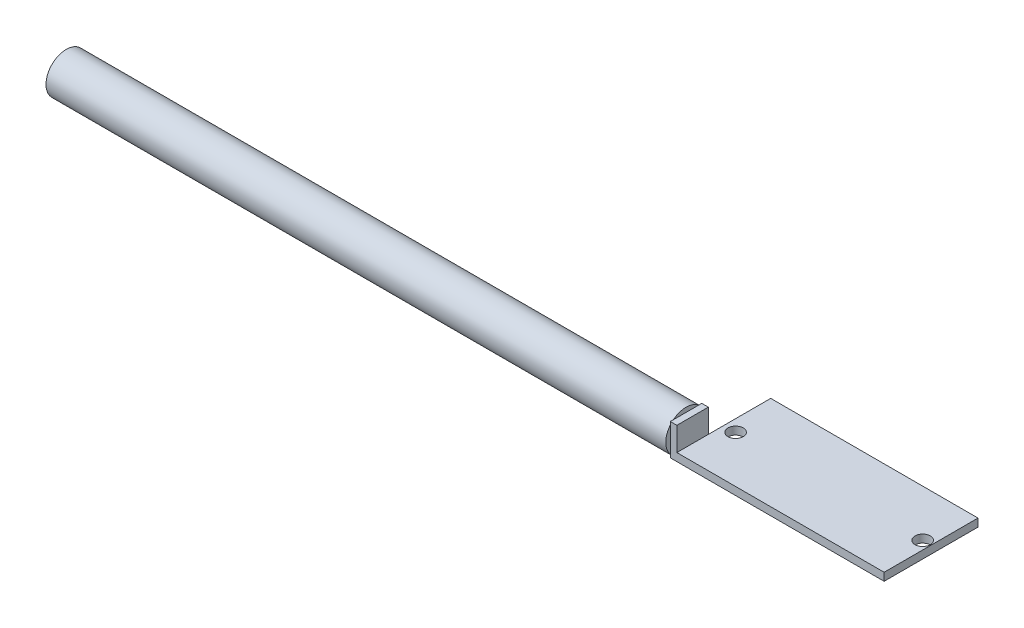
ISO-10303-21;
HEADER;
FILE_DESCRIPTION(('STEP AP214'),'2;1');
FILE_NAME('part.step','',(''),(''),'','','');
FILE_SCHEMA(('AUTOMOTIVE_DESIGN { 1 0 10303 214 1 1 1 1 }'));
ENDSEC;
DATA;
#1=APPLICATION_CONTEXT('core data for automotive mechanical design processes');
#2=APPLICATION_PROTOCOL_DEFINITION('international standard','automotive_design',2000,#1);
#3=PRODUCT_CONTEXT('',#1,'mechanical');
#4=PRODUCT('Part','Part','',(#3));
#5=PRODUCT_RELATED_PRODUCT_CATEGORY('part','',(#4));
#6=PRODUCT_DEFINITION_FORMATION('','',#4);
#7=PRODUCT_DEFINITION_CONTEXT('part definition',#1,'design');
#8=PRODUCT_DEFINITION('design','',#6,#7);
#9=PRODUCT_DEFINITION_SHAPE('','',#8);
#10=(LENGTH_UNIT() NAMED_UNIT(*) SI_UNIT(.MILLI.,.METRE.));
#11=(NAMED_UNIT(*) PLANE_ANGLE_UNIT() SI_UNIT($,.RADIAN.));
#12=(NAMED_UNIT(*) SI_UNIT($,.STERADIAN.) SOLID_ANGLE_UNIT());
#13=UNCERTAINTY_MEASURE_WITH_UNIT(LENGTH_MEASURE(1.E-05),#10,'distance_accuracy_value','');
#14=(GEOMETRIC_REPRESENTATION_CONTEXT(3) GLOBAL_UNCERTAINTY_ASSIGNED_CONTEXT((#13)) GLOBAL_UNIT_ASSIGNED_CONTEXT((#10,
#11,#12)) REPRESENTATION_CONTEXT('',''));
#15=CARTESIAN_POINT('',(0.,0.,0.));
#16=DIRECTION('',(0.,0.,1.));
#17=DIRECTION('',(1.,0.,0.));
#18=AXIS2_PLACEMENT_3D('',#15,#16,#17);
#19=CARTESIAN_POINT('',(-21.336,0.,0.));
#20=DIRECTION('',(-1.,0.,0.));
#21=DIRECTION('',(0.,0.,1.));
#22=AXIS2_PLACEMENT_3D('',#19,#20,#21);
#23=PLANE('',#22);
#24=CARTESIAN_POINT('',(-21.336,3.048,6.03885));
#25=DIRECTION('',(-1.,0.,0.));
#26=DIRECTION('',(0.,0.,1.));
#27=AXIS2_PLACEMENT_3D('',#24,#25,#26);
#28=CIRCLE('',#27,3.91795);
#29=CARTESIAN_POINT('',(-21.336,5.50971245325282,9.08685));
#30=VERTEX_POINT('',#29);
#31=CARTESIAN_POINT('',(-21.336,6.096,8.50056245325282));
#32=VERTEX_POINT('',#31);
#33=EDGE_CURVE('E151',#30,#32,#28,.T.);
#34=ORIENTED_EDGE('',*,*,#33,.F.);
#35=DIRECTION('',(0.,1.,0.));
#36=VECTOR('',#35,1.);
#37=CARTESIAN_POINT('',(-21.336,0.,9.08685));
#38=LINE('',#37,#36);
#39=CARTESIAN_POINT('',(-21.336,6.096,9.08685));
#40=VERTEX_POINT('',#39);
#41=EDGE_CURVE('E137',#30,#40,#38,.T.);
#42=ORIENTED_EDGE('',*,*,#41,.T.);
#43=DIRECTION('',(0.,0.,-1.));
#44=VECTOR('',#43,1.);
#45=CARTESIAN_POINT('',(-21.336,6.096,9.08685));
#46=LINE('',#45,#44);
#47=EDGE_CURVE('E180',#40,#32,#46,.T.);
#48=ORIENTED_EDGE('',*,*,#47,.T.);
#49=EDGE_LOOP('',(#34,#42,#48));
#50=FACE_BOUND('',#49,.T.);
#51=ADVANCED_FACE('F40',(#50),#23,.T.);
#52=CARTESIAN_POINT('',(-21.336,6.096,3.57713754674718));
#53=VERTEX_POINT('',#52);
#54=CARTESIAN_POINT('',(-21.336,5.50971245325282,2.99085));
#55=VERTEX_POINT('',#54);
#56=EDGE_CURVE('E11',#53,#55,#28,.T.);
#57=ORIENTED_EDGE('',*,*,#56,.F.);
#58=CARTESIAN_POINT('',(-21.336,6.096,2.99085));
#59=VERTEX_POINT('',#58);
#60=EDGE_CURVE('E134',#53,#59,#46,.T.);
#61=ORIENTED_EDGE('',*,*,#60,.T.);
#62=DIRECTION('',(0.,-1.,0.));
#63=VECTOR('',#62,1.);
#64=CARTESIAN_POINT('',(-21.336,0.,2.99085));
#65=LINE('',#64,#63);
#66=EDGE_CURVE('E177',#59,#55,#65,.T.);
#67=ORIENTED_EDGE('',*,*,#66,.T.);
#68=EDGE_LOOP('',(#57,#61,#67));
#69=FACE_BOUND('',#68,.T.);
#70=ADVANCED_FACE('F257',(#69),#23,.T.);
#71=CARTESIAN_POINT('',(-21.336,0.586287546747183,2.99085));
#72=VERTEX_POINT('',#71);
#73=CARTESIAN_POINT('',(-21.336,0.,3.57713754674719));
#74=VERTEX_POINT('',#73);
#75=EDGE_CURVE('E49',#72,#74,#28,.T.);
#76=ORIENTED_EDGE('',*,*,#75,.F.);
#77=CARTESIAN_POINT('',(-21.336,0.,2.99085));
#78=VERTEX_POINT('',#77);
#79=EDGE_CURVE('E178',#72,#78,#65,.T.);
#80=ORIENTED_EDGE('',*,*,#79,.T.);
#81=DIRECTION('',(0.,0.,1.));
#82=VECTOR('',#81,1.);
#83=CARTESIAN_POINT('',(-21.336,0.,9.08685));
#84=LINE('',#83,#82);
#85=EDGE_CURVE('E183',#78,#74,#84,.T.);
#86=ORIENTED_EDGE('',*,*,#85,.T.);
#87=EDGE_LOOP('',(#76,#80,#86));
#88=FACE_BOUND('',#87,.T.);
#89=ADVANCED_FACE('F274',(#88),#23,.T.);
#90=CARTESIAN_POINT('',(-20.066,1.524,9.08685));
#91=DIRECTION('',(1.,0.,0.));
#92=DIRECTION('',(0.,0.,-1.));
#93=AXIS2_PLACEMENT_3D('',#90,#91,#92);
#94=PLANE('',#93);
#95=DIRECTION('',(0.,-1.,0.));
#96=VECTOR('',#95,1.);
#97=CARTESIAN_POINT('',(-20.066,0.,2.99085));
#98=LINE('',#97,#96);
#99=CARTESIAN_POINT('',(-20.066,1.524,2.99085));
#100=VERTEX_POINT('',#99);
#101=CARTESIAN_POINT('',(-20.066,0.,2.99085));
#102=VERTEX_POINT('',#101);
#103=EDGE_CURVE('E156',#100,#102,#98,.T.);
#104=ORIENTED_EDGE('',*,*,#103,.F.);
#105=DIRECTION('',(0.,0.,1.));
#106=VECTOR('',#105,1.);
#107=CARTESIAN_POINT('',(-20.066,1.524,9.08685));
#108=LINE('',#107,#106);
#109=CARTESIAN_POINT('',(-20.066,1.524,-9.08685));
#110=VERTEX_POINT('',#109);
#111=EDGE_CURVE('E206',#110,#100,#108,.T.);
#112=ORIENTED_EDGE('',*,*,#111,.F.);
#113=DIRECTION('',(0.,-1.,0.));
#114=VECTOR('',#113,1.);
#115=CARTESIAN_POINT('',(-20.066,1.524,-9.08685));
#116=LINE('',#115,#114);
#117=CARTESIAN_POINT('',(-20.066,0.,-9.08685));
#118=VERTEX_POINT('',#117);
#119=EDGE_CURVE('E220',#110,#118,#116,.T.);
#120=ORIENTED_EDGE('',*,*,#119,.T.);
#121=DIRECTION('',(0.,0.,1.));
#122=VECTOR('',#121,1.);
#123=CARTESIAN_POINT('',(-20.066,0.,9.08685));
#124=LINE('',#123,#122);
#125=EDGE_CURVE('E216',#118,#102,#124,.T.);
#126=ORIENTED_EDGE('',*,*,#125,.T.);
#127=EDGE_LOOP('',(#104,#112,#120,#126));
#128=FACE_BOUND('',#127,.T.);
#129=ADVANCED_FACE('F236',(#128),#94,.F.);
#130=CARTESIAN_POINT('',(20.066,1.524,9.08685));
#131=DIRECTION('',(-1.,0.,0.));
#132=DIRECTION('',(0.,0.,1.));
#133=AXIS2_PLACEMENT_3D('',#130,#131,#132);
#134=PLANE('',#133);
#135=DIRECTION('',(0.,0.,-1.));
#136=VECTOR('',#135,1.);
#137=CARTESIAN_POINT('',(20.066,0.,9.08685));
#138=LINE('',#137,#136);
#139=CARTESIAN_POINT('',(20.066,0.,9.08685));
#140=VERTEX_POINT('',#139);
#141=CARTESIAN_POINT('',(20.066,0.,-9.08685));
#142=VERTEX_POINT('',#141);
#143=EDGE_CURVE('E198',#140,#142,#138,.T.);
#144=ORIENTED_EDGE('',*,*,#143,.T.);
#145=DIRECTION('',(0.,-1.,0.));
#146=VECTOR('',#145,1.);
#147=CARTESIAN_POINT('',(20.066,1.524,-9.08685));
#148=LINE('',#147,#146);
#149=CARTESIAN_POINT('',(20.066,1.524,-9.08685));
#150=VERTEX_POINT('',#149);
#151=EDGE_CURVE('E44',#150,#142,#148,.T.);
#152=ORIENTED_EDGE('',*,*,#151,.F.);
#153=DIRECTION('',(0.,0.,-1.));
#154=VECTOR('',#153,1.);
#155=CARTESIAN_POINT('',(20.066,1.524,9.08685));
#156=LINE('',#155,#154);
#157=CARTESIAN_POINT('',(20.066,1.524,9.08685));
#158=VERTEX_POINT('',#157);
#159=EDGE_CURVE('E199',#158,#150,#156,.T.);
#160=ORIENTED_EDGE('',*,*,#159,.F.);
#161=DIRECTION('',(0.,-1.,0.));
#162=VECTOR('',#161,1.);
#163=CARTESIAN_POINT('',(20.066,1.524,9.08685));
#164=LINE('',#163,#162);
#165=EDGE_CURVE('E211',#158,#140,#164,.T.);
#166=ORIENTED_EDGE('',*,*,#165,.T.);
#167=EDGE_LOOP('',(#144,#152,#160,#166));
#168=FACE_BOUND('',#167,.T.);
#169=ADVANCED_FACE('F42',(#168),#134,.F.);
#170=CARTESIAN_POINT('',(-20.066,1.524,-9.08685));
#171=DIRECTION('',(0.,0.,1.));
#172=DIRECTION('',(1.,0.,0.));
#173=AXIS2_PLACEMENT_3D('',#170,#171,#172);
#174=PLANE('',#173);
#175=DIRECTION('',(-1.,0.,0.));
#176=VECTOR('',#175,1.);
#177=CARTESIAN_POINT('',(-20.066,0.,-9.08685));
#178=LINE('',#177,#176);
#179=EDGE_CURVE('E214',#142,#118,#178,.T.);
#180=ORIENTED_EDGE('',*,*,#179,.T.);
#181=ORIENTED_EDGE('',*,*,#119,.F.);
#182=DIRECTION('',(-1.,0.,0.));
#183=VECTOR('',#182,1.);
#184=CARTESIAN_POINT('',(-20.066,1.524,-9.08685));
#185=LINE('',#184,#183);
#186=EDGE_CURVE('E202',#150,#110,#185,.T.);
#187=ORIENTED_EDGE('',*,*,#186,.F.);
#188=ORIENTED_EDGE('',*,*,#151,.T.);
#189=EDGE_LOOP('',(#180,#181,#187,#188));
#190=FACE_BOUND('',#189,.T.);
#191=ADVANCED_FACE('F229',(#190),#174,.F.);
#192=CARTESIAN_POINT('',(-20.066,1.524,9.08685));
#193=DIRECTION('',(0.,0.,-1.));
#194=DIRECTION('',(-1.,0.,0.));
#195=AXIS2_PLACEMENT_3D('',#192,#193,#194);
#196=PLANE('',#195);
#197=DIRECTION('',(1.,0.,0.));
#198=VECTOR('',#197,1.);
#199=CARTESIAN_POINT('',(-20.066,0.,9.08685));
#200=LINE('',#199,#198);
#201=CARTESIAN_POINT('',(-21.336,0.,9.08685));
#202=VERTEX_POINT('',#201);
#203=EDGE_CURVE('E203',#202,#140,#200,.T.);
#204=ORIENTED_EDGE('',*,*,#203,.T.);
#205=ORIENTED_EDGE('',*,*,#165,.F.);
#206=DIRECTION('',(1.,0.,0.));
#207=VECTOR('',#206,1.);
#208=CARTESIAN_POINT('',(-20.066,1.524,9.08685));
#209=LINE('',#208,#207);
#210=CARTESIAN_POINT('',(-20.066,1.524,9.08685));
#211=VERTEX_POINT('',#210);
#212=EDGE_CURVE('E209',#211,#158,#209,.T.);
#213=ORIENTED_EDGE('',*,*,#212,.F.);
#214=DIRECTION('',(0.,1.,0.));
#215=VECTOR('',#214,1.);
#216=CARTESIAN_POINT('',(-20.066,0.,9.08685));
#217=LINE('',#216,#215);
#218=CARTESIAN_POINT('',(-20.066,6.096,9.08685));
#219=VERTEX_POINT('',#218);
#220=EDGE_CURVE('E164',#211,#219,#217,.T.);
#221=ORIENTED_EDGE('',*,*,#220,.T.);
#222=DIRECTION('',(1.,0.,0.));
#223=VECTOR('',#222,1.);
#224=CARTESIAN_POINT('',(-21.336,6.096,9.08685));
#225=LINE('',#224,#223);
#226=EDGE_CURVE('E195',#40,#219,#225,.T.);
#227=ORIENTED_EDGE('',*,*,#226,.F.);
#228=ORIENTED_EDGE('',*,*,#41,.F.);
#229=CARTESIAN_POINT('',(-21.336,0.586287546747183,9.08685));
#230=VERTEX_POINT('',#229);
#231=EDGE_CURVE('E135',#230,#30,#38,.T.);
#232=ORIENTED_EDGE('',*,*,#231,.F.);
#233=EDGE_CURVE('E128',#202,#230,#38,.T.);
#234=ORIENTED_EDGE('',*,*,#233,.F.);
#235=EDGE_LOOP('',(#204,#205,#213,#221,#227,#228,#232,#234));
#236=FACE_BOUND('',#235,.T.);
#237=ADVANCED_FACE('F141',(#236),#196,.F.);
#238=CARTESIAN_POINT('',(0.,1.524,0.));
#239=DIRECTION('',(0.,-1.,0.));
#240=DIRECTION('',(0.,0.,-1.));
#241=AXIS2_PLACEMENT_3D('',#238,#239,#240);
#242=PLANE('',#241);
#243=CARTESIAN_POINT('',(-17.776825,1.524,0.));
#244=DIRECTION('',(0.,1.,0.));
#245=DIRECTION('',(0.,0.,1.));
#246=AXIS2_PLACEMENT_3D('',#243,#244,#245);
#247=CIRCLE('',#246,1.476375);
#248=CARTESIAN_POINT('',(-17.776825,1.524,1.476375));
#249=VERTEX_POINT('',#248);
#250=EDGE_CURVE('E315',#249,#249,#247,.T.);
#251=ORIENTED_EDGE('',*,*,#250,.F.);
#252=EDGE_LOOP('',(#251));
#253=FACE_BOUND('',#252,.T.);
#254=CARTESIAN_POINT('',(18.437225,1.524,0.));
#255=DIRECTION('',(0.,1.,0.));
#256=DIRECTION('',(0.,0.,1.));
#257=AXIS2_PLACEMENT_3D('',#254,#255,#256);
#258=CIRCLE('',#257,1.476375);
#259=CARTESIAN_POINT('',(18.437225,1.524,1.47637499999999));
#260=VERTEX_POINT('',#259);
#261=EDGE_CURVE('E323',#260,#260,#258,.T.);
#262=ORIENTED_EDGE('',*,*,#261,.F.);
#263=EDGE_LOOP('',(#262));
#264=FACE_BOUND('',#263,.T.);
#265=ORIENTED_EDGE('',*,*,#159,.T.);
#266=ORIENTED_EDGE('',*,*,#186,.T.);
#267=ORIENTED_EDGE('',*,*,#111,.T.);
#268=EDGE_CURVE('E205',#100,#211,#108,.T.);
#269=ORIENTED_EDGE('',*,*,#268,.T.);
#270=ORIENTED_EDGE('',*,*,#212,.T.);
#271=EDGE_LOOP('',(#265,#266,#267,#269,#270));
#272=FACE_BOUND('',#271,.T.);
#273=ADVANCED_FACE('F247',(#253,#264,#272),#242,.F.);
#274=CARTESIAN_POINT('',(0.,0.,0.));
#275=DIRECTION('',(0.,-1.,0.));
#276=DIRECTION('',(0.,0.,-1.));
#277=AXIS2_PLACEMENT_3D('',#274,#275,#276);
#278=PLANE('',#277);
#279=CARTESIAN_POINT('',(-17.776825,0.,0.));
#280=DIRECTION('',(0.,-1.,0.));
#281=DIRECTION('',(0.,0.,-1.));
#282=AXIS2_PLACEMENT_3D('',#279,#280,#281);
#283=CIRCLE('',#282,1.476375);
#284=CARTESIAN_POINT('',(-17.776825,0.,-1.476375));
#285=VERTEX_POINT('',#284);
#286=EDGE_CURVE('E150',#285,#285,#283,.F.);
#287=ORIENTED_EDGE('',*,*,#286,.T.);
#288=EDGE_LOOP('',(#287));
#289=FACE_BOUND('',#288,.T.);
#290=CARTESIAN_POINT('',(18.437225,0.,0.));
#291=DIRECTION('',(0.,-1.,0.));
#292=DIRECTION('',(0.,0.,-1.));
#293=AXIS2_PLACEMENT_3D('',#290,#291,#292);
#294=CIRCLE('',#293,1.476375);
#295=CARTESIAN_POINT('',(18.437225,0.,-1.476375));
#296=VERTEX_POINT('',#295);
#297=EDGE_CURVE('E320',#296,#296,#294,.F.);
#298=ORIENTED_EDGE('',*,*,#297,.T.);
#299=EDGE_LOOP('',(#298));
#300=FACE_BOUND('',#299,.T.);
#301=ORIENTED_EDGE('',*,*,#143,.F.);
#302=ORIENTED_EDGE('',*,*,#203,.F.);
#303=CARTESIAN_POINT('',(-21.336,0.,8.50056245325282));
#304=VERTEX_POINT('',#303);
#305=EDGE_CURVE('E131',#304,#202,#84,.T.);
#306=ORIENTED_EDGE('',*,*,#305,.F.);
#307=EDGE_CURVE('E65',#74,#304,#84,.T.);
#308=ORIENTED_EDGE('',*,*,#307,.F.);
#309=ORIENTED_EDGE('',*,*,#85,.F.);
#310=DIRECTION('',(1.,0.,0.));
#311=VECTOR('',#310,1.);
#312=CARTESIAN_POINT('',(-21.336,0.,2.99085));
#313=LINE('',#312,#311);
#314=EDGE_CURVE('E185',#78,#102,#313,.T.);
#315=ORIENTED_EDGE('',*,*,#314,.T.);
#316=ORIENTED_EDGE('',*,*,#125,.F.);
#317=ORIENTED_EDGE('',*,*,#179,.F.);
#318=EDGE_LOOP('',(#301,#302,#306,#308,#309,#315,#316,#317));
#319=FACE_BOUND('',#318,.T.);
#320=ADVANCED_FACE('F234',(#289,#300,#319),#278,.T.);
#321=CARTESIAN_POINT('',(-21.336,6.096,9.08685));
#322=DIRECTION('',(0.,-1.,0.));
#323=DIRECTION('',(0.,0.,-1.));
#324=AXIS2_PLACEMENT_3D('',#321,#322,#323);
#325=PLANE('',#324);
#326=DIRECTION('',(0.,0.,-1.));
#327=VECTOR('',#326,1.);
#328=CARTESIAN_POINT('',(-20.066,6.096,9.08685));
#329=LINE('',#328,#327);
#330=CARTESIAN_POINT('',(-20.066,6.096,2.99085));
#331=VERTEX_POINT('',#330);
#332=EDGE_CURVE('E187',#219,#331,#329,.T.);
#333=ORIENTED_EDGE('',*,*,#332,.T.);
#334=DIRECTION('',(1.,0.,0.));
#335=VECTOR('',#334,1.);
#336=CARTESIAN_POINT('',(-21.336,6.096,2.99085));
#337=LINE('',#336,#335);
#338=EDGE_CURVE('E192',#59,#331,#337,.T.);
#339=ORIENTED_EDGE('',*,*,#338,.F.);
#340=ORIENTED_EDGE('',*,*,#60,.F.);
#341=EDGE_CURVE('E254',#32,#53,#46,.T.);
#342=ORIENTED_EDGE('',*,*,#341,.F.);
#343=ORIENTED_EDGE('',*,*,#47,.F.);
#344=ORIENTED_EDGE('',*,*,#226,.T.);
#345=EDGE_LOOP('',(#333,#339,#340,#342,#343,#344));
#346=FACE_BOUND('',#345,.T.);
#347=ADVANCED_FACE('F250',(#346),#325,.F.);
#348=CARTESIAN_POINT('',(-21.336,0.,2.99085));
#349=DIRECTION('',(0.,0.,1.));
#350=DIRECTION('',(1.,0.,0.));
#351=AXIS2_PLACEMENT_3D('',#348,#349,#350);
#352=PLANE('',#351);
#353=EDGE_CURVE('E159',#331,#100,#98,.T.);
#354=ORIENTED_EDGE('',*,*,#353,.T.);
#355=ORIENTED_EDGE('',*,*,#103,.T.);
#356=ORIENTED_EDGE('',*,*,#314,.F.);
#357=ORIENTED_EDGE('',*,*,#79,.F.);
#358=EDGE_CURVE('E172',#55,#72,#65,.T.);
#359=ORIENTED_EDGE('',*,*,#358,.F.);
#360=ORIENTED_EDGE('',*,*,#66,.F.);
#361=ORIENTED_EDGE('',*,*,#338,.T.);
#362=EDGE_LOOP('',(#354,#355,#356,#357,#359,#360,#361));
#363=FACE_BOUND('',#362,.T.);
#364=ADVANCED_FACE('F237',(#363),#352,.F.);
#365=EDGE_CURVE('E58',#304,#230,#28,.T.);
#366=ORIENTED_EDGE('',*,*,#365,.F.);
#367=ORIENTED_EDGE('',*,*,#305,.T.);
#368=ORIENTED_EDGE('',*,*,#233,.T.);
#369=EDGE_LOOP('',(#366,#367,#368));
#370=FACE_BOUND('',#369,.T.);
#371=ADVANCED_FACE('F130',(#370),#23,.T.);
#372=CARTESIAN_POINT('',(-20.066,0.,0.));
#373=DIRECTION('',(-1.,0.,0.));
#374=DIRECTION('',(0.,0.,1.));
#375=AXIS2_PLACEMENT_3D('',#372,#373,#374);
#376=PLANE('',#375);
#377=ORIENTED_EDGE('',*,*,#268,.F.);
#378=ORIENTED_EDGE('',*,*,#353,.F.);
#379=ORIENTED_EDGE('',*,*,#332,.F.);
#380=ORIENTED_EDGE('',*,*,#220,.F.);
#381=EDGE_LOOP('',(#377,#378,#379,#380));
#382=FACE_BOUND('',#381,.T.);
#383=ADVANCED_FACE('F243',(#382),#376,.F.);
#384=CARTESIAN_POINT('',(-21.336,3.048,6.03885));
#385=DIRECTION('',(-1.,0.,0.));
#386=DIRECTION('',(0.,0.,1.));
#387=AXIS2_PLACEMENT_3D('',#384,#385,#386);
#388=PLANE('',#387);
#389=EDGE_CURVE('E145',#230,#30,#28,.T.);
#390=ORIENTED_EDGE('',*,*,#389,.F.);
#391=ORIENTED_EDGE('',*,*,#231,.T.);
#392=EDGE_LOOP('',(#390,#391));
#393=FACE_BOUND('',#392,.T.);
#394=ADVANCED_FACE('F146',(#393),#388,.F.);
#395=EDGE_CURVE('E51',#32,#53,#28,.T.);
#396=ORIENTED_EDGE('',*,*,#395,.F.);
#397=ORIENTED_EDGE('',*,*,#341,.T.);
#398=EDGE_LOOP('',(#396,#397));
#399=FACE_BOUND('',#398,.T.);
#400=ADVANCED_FACE('F259',(#399),#388,.F.);
#401=EDGE_CURVE('E165',#55,#72,#28,.T.);
#402=ORIENTED_EDGE('',*,*,#401,.F.);
#403=ORIENTED_EDGE('',*,*,#358,.T.);
#404=EDGE_LOOP('',(#402,#403));
#405=FACE_BOUND('',#404,.T.);
#406=ADVANCED_FACE('F171',(#405),#388,.F.);
#407=EDGE_CURVE('E149',#74,#304,#28,.T.);
#408=ORIENTED_EDGE('',*,*,#407,.F.);
#409=ORIENTED_EDGE('',*,*,#307,.T.);
#410=EDGE_LOOP('',(#408,#409));
#411=FACE_BOUND('',#410,.T.);
#412=ADVANCED_FACE('F266',(#411),#388,.F.);
#413=CARTESIAN_POINT('',(-141.336,3.048,6.03885));
#414=DIRECTION('',(1.,0.,0.));
#415=DIRECTION('',(0.,0.,-1.));
#416=AXIS2_PLACEMENT_3D('',#413,#414,#415);
#417=CYLINDRICAL_SURFACE('',#416,3.91795);
#418=CARTESIAN_POINT('',(-141.336,3.048,6.03885));
#419=DIRECTION('',(-1.,0.,0.));
#420=DIRECTION('',(0.,0.,1.));
#421=AXIS2_PLACEMENT_3D('',#418,#419,#420);
#422=CIRCLE('',#421,3.91795);
#423=CARTESIAN_POINT('',(-141.336,3.048,9.9568));
#424=VERTEX_POINT('',#423);
#425=EDGE_CURVE('E161',#424,#424,#422,.T.);
#426=ORIENTED_EDGE('',*,*,#425,.F.);
#427=EDGE_LOOP('',(#426));
#428=FACE_BOUND('',#427,.T.);
#429=ORIENTED_EDGE('',*,*,#33,.T.);
#430=ORIENTED_EDGE('',*,*,#395,.T.);
#431=ORIENTED_EDGE('',*,*,#56,.T.);
#432=ORIENTED_EDGE('',*,*,#401,.T.);
#433=ORIENTED_EDGE('',*,*,#75,.T.);
#434=ORIENTED_EDGE('',*,*,#407,.T.);
#435=ORIENTED_EDGE('',*,*,#365,.T.);
#436=ORIENTED_EDGE('',*,*,#389,.T.);
#437=EDGE_LOOP('',(#429,#430,#431,#432,#433,#434,#435,#436));
#438=FACE_BOUND('',#437,.T.);
#439=ADVANCED_FACE('F153',(#428,#438),#417,.T.);
#440=CARTESIAN_POINT('',(-141.336,3.048,6.03885));
#441=DIRECTION('',(-1.,0.,0.));
#442=DIRECTION('',(0.,0.,1.));
#443=AXIS2_PLACEMENT_3D('',#440,#441,#442);
#444=PLANE('',#443);
#445=ORIENTED_EDGE('',*,*,#425,.T.);
#446=EDGE_LOOP('',(#445));
#447=FACE_BOUND('',#446,.T.);
#448=ADVANCED_FACE('F293',(#447),#444,.T.);
#449=CARTESIAN_POINT('',(18.437225,-4.17581909629715,0.));
#450=DIRECTION('',(0.,1.,0.));
#451=DIRECTION('',(0.,0.,1.));
#452=AXIS2_PLACEMENT_3D('',#449,#450,#451);
#453=CYLINDRICAL_SURFACE('',#452,1.476375);
#454=ORIENTED_EDGE('',*,*,#261,.T.);
#455=EDGE_LOOP('',(#454));
#456=FACE_BOUND('',#455,.T.);
#457=ORIENTED_EDGE('',*,*,#297,.F.);
#458=EDGE_LOOP('',(#457));
#459=FACE_BOUND('',#458,.T.);
#460=ADVANCED_FACE('F298',(#456,#459),#453,.F.);
#461=CARTESIAN_POINT('',(-17.776825,-4.17581909629715,0.));
#462=DIRECTION('',(0.,1.,0.));
#463=DIRECTION('',(0.,0.,1.));
#464=AXIS2_PLACEMENT_3D('',#461,#462,#463);
#465=CYLINDRICAL_SURFACE('',#464,1.476375);
#466=ORIENTED_EDGE('',*,*,#250,.T.);
#467=EDGE_LOOP('',(#466));
#468=FACE_BOUND('',#467,.T.);
#469=ORIENTED_EDGE('',*,*,#286,.F.);
#470=EDGE_LOOP('',(#469));
#471=FACE_BOUND('',#470,.T.);
#472=ADVANCED_FACE('F304',(#468,#471),#465,.F.);
#473=CLOSED_SHELL('',(#51,#70,#89,#129,#169,#191,#237,#273,#320,#347,#364,#371,#383,#394,#400,
#406,#412,#439,#448,#460,#472));
#474=MANIFOLD_SOLID_BREP('B2',#473);
#475=ADVANCED_BREP_SHAPE_REPRESENTATION('',(#18,#474),#14);
#476=SHAPE_DEFINITION_REPRESENTATION(#9,#475);
ENDSEC;
END-ISO-10303-21;
